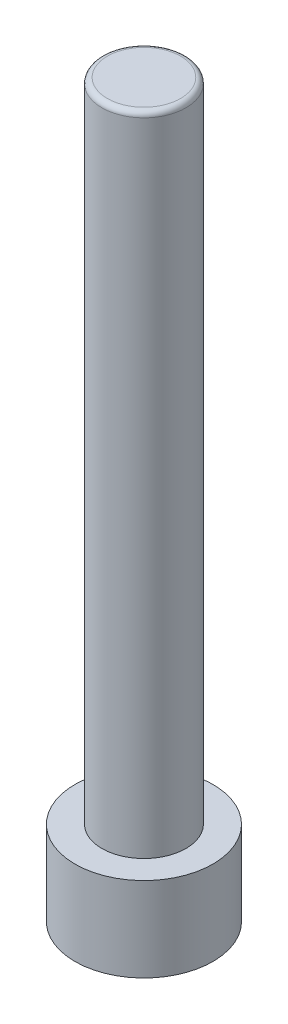
ISO-10303-21;
HEADER;
FILE_DESCRIPTION(('STEP AP214'),'2;1');
FILE_NAME('part.step','',(''),(''),'','','');
FILE_SCHEMA(('AUTOMOTIVE_DESIGN { 1 0 10303 214 1 1 1 1 }'));
ENDSEC;
DATA;
#1=APPLICATION_CONTEXT('core data for automotive mechanical design processes');
#2=APPLICATION_PROTOCOL_DEFINITION('international standard','automotive_design',2000,#1);
#3=PRODUCT_CONTEXT('',#1,'mechanical');
#4=PRODUCT('Part','Part','',(#3));
#5=PRODUCT_RELATED_PRODUCT_CATEGORY('part','',(#4));
#6=PRODUCT_DEFINITION_FORMATION('','',#4);
#7=PRODUCT_DEFINITION_CONTEXT('part definition',#1,'design');
#8=PRODUCT_DEFINITION('design','',#6,#7);
#9=PRODUCT_DEFINITION_SHAPE('','',#8);
#10=(LENGTH_UNIT() NAMED_UNIT(*) SI_UNIT(.MILLI.,.METRE.));
#11=(NAMED_UNIT(*) PLANE_ANGLE_UNIT() SI_UNIT($,.RADIAN.));
#12=(NAMED_UNIT(*) SI_UNIT($,.STERADIAN.) SOLID_ANGLE_UNIT());
#13=UNCERTAINTY_MEASURE_WITH_UNIT(LENGTH_MEASURE(1.E-05),#10,'distance_accuracy_value','');
#14=(GEOMETRIC_REPRESENTATION_CONTEXT(3) GLOBAL_UNCERTAINTY_ASSIGNED_CONTEXT((#13)) GLOBAL_UNIT_ASSIGNED_CONTEXT((#10,
#11,#12)) REPRESENTATION_CONTEXT('',''));
#15=CARTESIAN_POINT('',(0.,0.,0.));
#16=DIRECTION('',(0.,0.,1.));
#17=DIRECTION('',(1.,0.,0.));
#18=AXIS2_PLACEMENT_3D('',#15,#16,#17);
#19=CARTESIAN_POINT('',(0.,67.83,0.));
#20=DIRECTION('',(0.,-1.,0.));
#21=DIRECTION('',(0.,0.,-1.));
#22=AXIS2_PLACEMENT_3D('',#19,#20,#21);
#23=CYLINDRICAL_SURFACE('',#22,6.4);
#24=CARTESIAN_POINT('',(0.,0.,0.));
#25=DIRECTION('',(0.,1.,0.));
#26=DIRECTION('',(0.,0.,1.));
#27=AXIS2_PLACEMENT_3D('',#24,#25,#26);
#28=CIRCLE('',#27,6.4);
#29=CARTESIAN_POINT('',(0.,0.,6.4));
#30=VERTEX_POINT('',#29);
#31=EDGE_CURVE('E148',#30,#30,#28,.T.);
#32=ORIENTED_EDGE('',*,*,#31,.T.);
#33=EDGE_LOOP('',(#32));
#34=FACE_BOUND('',#33,.T.);
#35=CARTESIAN_POINT('',(0.,7.83,0.));
#36=DIRECTION('',(0.,1.,0.));
#37=DIRECTION('',(0.,0.,1.));
#38=AXIS2_PLACEMENT_3D('',#35,#36,#37);
#39=CIRCLE('',#38,6.4);
#40=CARTESIAN_POINT('',(0.,7.83,6.4));
#41=VERTEX_POINT('',#40);
#42=EDGE_CURVE('E147',#41,#41,#39,.T.);
#43=ORIENTED_EDGE('',*,*,#42,.F.);
#44=EDGE_LOOP('',(#43));
#45=FACE_BOUND('',#44,.T.);
#46=ADVANCED_FACE('F37',(#34,#45),#23,.T.);
#47=CARTESIAN_POINT('',(0.,0.,0.));
#48=DIRECTION('',(0.,1.,0.));
#49=DIRECTION('',(0.,0.,1.));
#50=AXIS2_PLACEMENT_3D('',#47,#48,#49);
#51=PLANE('',#50);
#52=DIRECTION('',(-0.5,0.,0.866025403784438));
#53=VECTOR('',#52,1.);
#54=CARTESIAN_POINT('',(3.46410161513775,0.,0.));
#55=LINE('',#54,#53);
#56=CARTESIAN_POINT('',(3.46410161513776,0.,0.));
#57=VERTEX_POINT('',#56);
#58=CARTESIAN_POINT('',(1.73205080756888,0.,3.));
#59=VERTEX_POINT('',#58);
#60=EDGE_CURVE('E126',#57,#59,#55,.T.);
#61=ORIENTED_EDGE('',*,*,#60,.F.);
#62=DIRECTION('',(0.5,0.,0.866025403784439));
#63=VECTOR('',#62,1.);
#64=CARTESIAN_POINT('',(1.73205080756888,0.,-3.));
#65=LINE('',#64,#63);
#66=CARTESIAN_POINT('',(1.73205080756888,0.,-3.));
#67=VERTEX_POINT('',#66);
#68=EDGE_CURVE('E52',#67,#57,#65,.T.);
#69=ORIENTED_EDGE('',*,*,#68,.F.);
#70=DIRECTION('',(1.,0.,0.));
#71=VECTOR('',#70,1.);
#72=CARTESIAN_POINT('',(-1.73205080756888,0.,-3.));
#73=LINE('',#72,#71);
#74=CARTESIAN_POINT('',(-1.73205080756888,0.,-3.));
#75=VERTEX_POINT('',#74);
#76=EDGE_CURVE('E135',#75,#67,#73,.T.);
#77=ORIENTED_EDGE('',*,*,#76,.F.);
#78=DIRECTION('',(0.5,0.,-0.866025403784439));
#79=VECTOR('',#78,1.);
#80=CARTESIAN_POINT('',(-3.46410161513775,0.,0.));
#81=LINE('',#80,#79);
#82=CARTESIAN_POINT('',(-3.46410161513775,0.,0.));
#83=VERTEX_POINT('',#82);
#84=EDGE_CURVE('E133',#83,#75,#81,.T.);
#85=ORIENTED_EDGE('',*,*,#84,.F.);
#86=DIRECTION('',(-0.5,0.,-0.866025403784439));
#87=VECTOR('',#86,1.);
#88=CARTESIAN_POINT('',(-1.73205080756888,0.,3.));
#89=LINE('',#88,#87);
#90=CARTESIAN_POINT('',(-1.73205080756888,0.,3.));
#91=VERTEX_POINT('',#90);
#92=EDGE_CURVE('E100',#91,#83,#89,.T.);
#93=ORIENTED_EDGE('',*,*,#92,.F.);
#94=DIRECTION('',(-1.,0.,0.));
#95=VECTOR('',#94,1.);
#96=CARTESIAN_POINT('',(1.73205080756888,0.,3.));
#97=LINE('',#96,#95);
#98=EDGE_CURVE('E129',#59,#91,#97,.T.);
#99=ORIENTED_EDGE('',*,*,#98,.F.);
#100=EDGE_LOOP('',(#61,#69,#77,#85,#93,#99));
#101=FACE_BOUND('',#100,.T.);
#102=ORIENTED_EDGE('',*,*,#31,.F.);
#103=EDGE_LOOP('',(#102));
#104=FACE_BOUND('',#103,.T.);
#105=ADVANCED_FACE('F166',(#101,#104),#51,.F.);
#106=CARTESIAN_POINT('',(0.,7.83,0.));
#107=DIRECTION('',(0.,1.,0.));
#108=DIRECTION('',(0.,0.,1.));
#109=AXIS2_PLACEMENT_3D('',#106,#107,#108);
#110=PLANE('',#109);
#111=CARTESIAN_POINT('',(0.,7.83,0.));
#112=DIRECTION('',(0.,1.,0.));
#113=DIRECTION('',(0.,0.,1.));
#114=AXIS2_PLACEMENT_3D('',#111,#112,#113);
#115=CIRCLE('',#114,3.9);
#116=CARTESIAN_POINT('',(0.,7.83,3.9));
#117=VERTEX_POINT('',#116);
#118=EDGE_CURVE('E139',#117,#117,#115,.T.);
#119=ORIENTED_EDGE('',*,*,#118,.F.);
#120=EDGE_LOOP('',(#119));
#121=FACE_BOUND('',#120,.T.);
#122=ORIENTED_EDGE('',*,*,#42,.T.);
#123=EDGE_LOOP('',(#122));
#124=FACE_BOUND('',#123,.T.);
#125=ADVANCED_FACE('F171',(#121,#124),#110,.T.);
#126=CARTESIAN_POINT('',(0.,7.83,0.));
#127=DIRECTION('',(0.,1.,0.));
#128=DIRECTION('',(0.,0.,1.));
#129=AXIS2_PLACEMENT_3D('',#126,#127,#128);
#130=CYLINDRICAL_SURFACE('',#129,3.9);
#131=CARTESIAN_POINT('',(0.,67.33,0.));
#132=DIRECTION('',(0.,1.,0.));
#133=DIRECTION('',(0.,0.,1.));
#134=AXIS2_PLACEMENT_3D('',#131,#132,#133);
#135=CIRCLE('',#134,3.9);
#136=CARTESIAN_POINT('',(0.,67.33,3.9));
#137=VERTEX_POINT('',#136);
#138=EDGE_CURVE('E12',#137,#137,#135,.F.);
#139=ORIENTED_EDGE('',*,*,#138,.T.);
#140=EDGE_LOOP('',(#139));
#141=FACE_BOUND('',#140,.T.);
#142=ORIENTED_EDGE('',*,*,#118,.T.);
#143=EDGE_LOOP('',(#142));
#144=FACE_BOUND('',#143,.T.);
#145=ADVANCED_FACE('F179',(#141,#144),#130,.T.);
#146=CARTESIAN_POINT('',(0.,67.83,0.));
#147=DIRECTION('',(0.,1.,0.));
#148=DIRECTION('',(0.,0.,1.));
#149=AXIS2_PLACEMENT_3D('',#146,#147,#148);
#150=PLANE('',#149);
#151=CARTESIAN_POINT('',(0.,67.83,0.));
#152=DIRECTION('',(0.,1.,0.));
#153=DIRECTION('',(0.,0.,1.));
#154=AXIS2_PLACEMENT_3D('',#151,#152,#153);
#155=CIRCLE('',#154,3.4);
#156=CARTESIAN_POINT('',(0.,67.83,3.4));
#157=VERTEX_POINT('',#156);
#158=EDGE_CURVE('E45',#157,#157,#155,.T.);
#159=ORIENTED_EDGE('',*,*,#158,.T.);
#160=EDGE_LOOP('',(#159));
#161=FACE_BOUND('',#160,.T.);
#162=ADVANCED_FACE('F155',(#161),#150,.T.);
#163=CARTESIAN_POINT('',(1.73205080756888,5.64,-3.));
#164=DIRECTION('',(0.866025403784439,0.,-0.5));
#165=DIRECTION('',(-0.5,0.,-0.866025403784439));
#166=AXIS2_PLACEMENT_3D('',#163,#164,#165);
#167=PLANE('',#166);
#168=ORIENTED_EDGE('',*,*,#68,.T.);
#169=DIRECTION('',(0.,-1.,0.));
#170=VECTOR('',#169,1.);
#171=CARTESIAN_POINT('',(3.46410161513775,5.64,0.));
#172=LINE('',#171,#170);
#173=CARTESIAN_POINT('',(3.46410161513775,5.64,0.));
#174=VERTEX_POINT('',#173);
#175=EDGE_CURVE('E82',#174,#57,#172,.T.);
#176=ORIENTED_EDGE('',*,*,#175,.F.);
#177=DIRECTION('',(0.5,0.,0.866025403784439));
#178=VECTOR('',#177,1.);
#179=CARTESIAN_POINT('',(1.73205080756888,5.64,-3.));
#180=LINE('',#179,#178);
#181=CARTESIAN_POINT('',(1.73205080756888,5.64,-3.));
#182=VERTEX_POINT('',#181);
#183=EDGE_CURVE('E137',#182,#174,#180,.T.);
#184=ORIENTED_EDGE('',*,*,#183,.F.);
#185=DIRECTION('',(0.,-1.,0.));
#186=VECTOR('',#185,1.);
#187=CARTESIAN_POINT('',(1.73205080756888,5.64,-3.));
#188=LINE('',#187,#186);
#189=EDGE_CURVE('E60',#182,#67,#188,.T.);
#190=ORIENTED_EDGE('',*,*,#189,.T.);
#191=EDGE_LOOP('',(#168,#176,#184,#190));
#192=FACE_BOUND('',#191,.T.);
#193=ADVANCED_FACE('F178',(#192),#167,.F.);
#194=CARTESIAN_POINT('',(-1.73205080756888,5.64,-3.));
#195=DIRECTION('',(0.,0.,-1.));
#196=DIRECTION('',(-1.,0.,0.));
#197=AXIS2_PLACEMENT_3D('',#194,#195,#196);
#198=PLANE('',#197);
#199=ORIENTED_EDGE('',*,*,#76,.T.);
#200=ORIENTED_EDGE('',*,*,#189,.F.);
#201=DIRECTION('',(1.,0.,0.));
#202=VECTOR('',#201,1.);
#203=CARTESIAN_POINT('',(-1.73205080756888,5.64,-3.));
#204=LINE('',#203,#202);
#205=CARTESIAN_POINT('',(-1.73205080756888,5.64,-3.));
#206=VERTEX_POINT('',#205);
#207=EDGE_CURVE('E112',#206,#182,#204,.T.);
#208=ORIENTED_EDGE('',*,*,#207,.F.);
#209=DIRECTION('',(0.,-1.,0.));
#210=VECTOR('',#209,1.);
#211=CARTESIAN_POINT('',(-1.73205080756888,5.64,-3.));
#212=LINE('',#211,#210);
#213=EDGE_CURVE('E104',#206,#75,#212,.T.);
#214=ORIENTED_EDGE('',*,*,#213,.T.);
#215=EDGE_LOOP('',(#199,#200,#208,#214));
#216=FACE_BOUND('',#215,.T.);
#217=ADVANCED_FACE('F188',(#216),#198,.F.);
#218=CARTESIAN_POINT('',(-3.46410161513775,5.64,0.));
#219=DIRECTION('',(-0.866025403784439,0.,-0.5));
#220=DIRECTION('',(-0.5,0.,0.866025403784439));
#221=AXIS2_PLACEMENT_3D('',#218,#219,#220);
#222=PLANE('',#221);
#223=ORIENTED_EDGE('',*,*,#84,.T.);
#224=ORIENTED_EDGE('',*,*,#213,.F.);
#225=DIRECTION('',(0.5,0.,-0.866025403784439));
#226=VECTOR('',#225,1.);
#227=CARTESIAN_POINT('',(-3.46410161513775,5.64,0.));
#228=LINE('',#227,#226);
#229=CARTESIAN_POINT('',(-3.46410161513775,5.64,0.));
#230=VERTEX_POINT('',#229);
#231=EDGE_CURVE('E108',#230,#206,#228,.T.);
#232=ORIENTED_EDGE('',*,*,#231,.F.);
#233=DIRECTION('',(0.,-1.,0.));
#234=VECTOR('',#233,1.);
#235=CARTESIAN_POINT('',(-3.46410161513775,5.64,0.));
#236=LINE('',#235,#234);
#237=EDGE_CURVE('E93',#230,#83,#236,.T.);
#238=ORIENTED_EDGE('',*,*,#237,.T.);
#239=EDGE_LOOP('',(#223,#224,#232,#238));
#240=FACE_BOUND('',#239,.T.);
#241=ADVANCED_FACE('F109',(#240),#222,.F.);
#242=CARTESIAN_POINT('',(-1.73205080756888,5.64,3.));
#243=DIRECTION('',(-0.866025403784439,0.,0.5));
#244=DIRECTION('',(0.5,0.,0.866025403784439));
#245=AXIS2_PLACEMENT_3D('',#242,#243,#244);
#246=PLANE('',#245);
#247=ORIENTED_EDGE('',*,*,#92,.T.);
#248=ORIENTED_EDGE('',*,*,#237,.F.);
#249=DIRECTION('',(-0.5,0.,-0.866025403784439));
#250=VECTOR('',#249,1.);
#251=CARTESIAN_POINT('',(-1.73205080756888,5.64,3.));
#252=LINE('',#251,#250);
#253=CARTESIAN_POINT('',(-1.73205080756888,5.64,3.));
#254=VERTEX_POINT('',#253);
#255=EDGE_CURVE('E97',#254,#230,#252,.T.);
#256=ORIENTED_EDGE('',*,*,#255,.F.);
#257=DIRECTION('',(0.,-1.,0.));
#258=VECTOR('',#257,1.);
#259=CARTESIAN_POINT('',(-1.73205080756888,5.64,3.));
#260=LINE('',#259,#258);
#261=EDGE_CURVE('E105',#254,#91,#260,.T.);
#262=ORIENTED_EDGE('',*,*,#261,.T.);
#263=EDGE_LOOP('',(#247,#248,#256,#262));
#264=FACE_BOUND('',#263,.T.);
#265=ADVANCED_FACE('F95',(#264),#246,.F.);
#266=CARTESIAN_POINT('',(1.73205080756888,5.64,3.));
#267=DIRECTION('',(0.,0.,1.));
#268=DIRECTION('',(1.,0.,0.));
#269=AXIS2_PLACEMENT_3D('',#266,#267,#268);
#270=PLANE('',#269);
#271=ORIENTED_EDGE('',*,*,#98,.T.);
#272=ORIENTED_EDGE('',*,*,#261,.F.);
#273=DIRECTION('',(-1.,0.,0.));
#274=VECTOR('',#273,1.);
#275=CARTESIAN_POINT('',(1.73205080756888,5.64,3.));
#276=LINE('',#275,#274);
#277=CARTESIAN_POINT('',(1.73205080756888,5.64,3.));
#278=VERTEX_POINT('',#277);
#279=EDGE_CURVE('E118',#278,#254,#276,.T.);
#280=ORIENTED_EDGE('',*,*,#279,.F.);
#281=DIRECTION('',(0.,-1.,0.));
#282=VECTOR('',#281,1.);
#283=CARTESIAN_POINT('',(1.73205080756888,5.64,3.));
#284=LINE('',#283,#282);
#285=EDGE_CURVE('E142',#278,#59,#284,.T.);
#286=ORIENTED_EDGE('',*,*,#285,.T.);
#287=EDGE_LOOP('',(#271,#272,#280,#286));
#288=FACE_BOUND('',#287,.T.);
#289=ADVANCED_FACE('F191',(#288),#270,.F.);
#290=CARTESIAN_POINT('',(3.46410161513775,5.64,0.));
#291=DIRECTION('',(0.866025403784439,0.,0.5));
#292=DIRECTION('',(0.5,0.,-0.866025403784439));
#293=AXIS2_PLACEMENT_3D('',#290,#291,#292);
#294=PLANE('',#293);
#295=ORIENTED_EDGE('',*,*,#60,.T.);
#296=ORIENTED_EDGE('',*,*,#285,.F.);
#297=DIRECTION('',(-0.5,0.,0.866025403784438));
#298=VECTOR('',#297,1.);
#299=CARTESIAN_POINT('',(3.46410161513775,5.64,0.));
#300=LINE('',#299,#298);
#301=EDGE_CURVE('E120',#174,#278,#300,.T.);
#302=ORIENTED_EDGE('',*,*,#301,.F.);
#303=ORIENTED_EDGE('',*,*,#175,.T.);
#304=EDGE_LOOP('',(#295,#296,#302,#303));
#305=FACE_BOUND('',#304,.T.);
#306=ADVANCED_FACE('F162',(#305),#294,.F.);
#307=CARTESIAN_POINT('',(0.,5.64,0.));
#308=DIRECTION('',(0.,-1.,0.));
#309=DIRECTION('',(0.,0.,-1.));
#310=AXIS2_PLACEMENT_3D('',#307,#308,#309);
#311=PLANE('',#310);
#312=ORIENTED_EDGE('',*,*,#183,.T.);
#313=ORIENTED_EDGE('',*,*,#301,.T.);
#314=ORIENTED_EDGE('',*,*,#279,.T.);
#315=ORIENTED_EDGE('',*,*,#255,.T.);
#316=ORIENTED_EDGE('',*,*,#231,.T.);
#317=ORIENTED_EDGE('',*,*,#207,.T.);
#318=EDGE_LOOP('',(#312,#313,#314,#315,#316,#317));
#319=FACE_BOUND('',#318,.T.);
#320=ADVANCED_FACE('F115',(#319),#311,.T.);
#321=CARTESIAN_POINT('',(0.,67.33,0.));
#322=DIRECTION('',(0.,1.,0.));
#323=DIRECTION('',(0.,0.,1.));
#324=AXIS2_PLACEMENT_3D('',#321,#322,#323);
#325=TOROIDAL_SURFACE('',#324,3.4,0.5);
#326=ORIENTED_EDGE('',*,*,#138,.F.);
#327=EDGE_LOOP('',(#326));
#328=FACE_BOUND('',#327,.T.);
#329=ORIENTED_EDGE('',*,*,#158,.F.);
#330=EDGE_LOOP('',(#329));
#331=FACE_BOUND('',#330,.T.);
#332=ADVANCED_FACE('F39',(#328,#331),#325,.T.);
#333=CLOSED_SHELL('',(#46,#105,#125,#145,#162,#193,#217,#241,#265,#289,#306,#320,#332));
#334=MANIFOLD_SOLID_BREP('B2',#333);
#335=ADVANCED_BREP_SHAPE_REPRESENTATION('',(#18,#334),#14);
#336=SHAPE_DEFINITION_REPRESENTATION(#9,#335);
ENDSEC;
END-ISO-10303-21;
